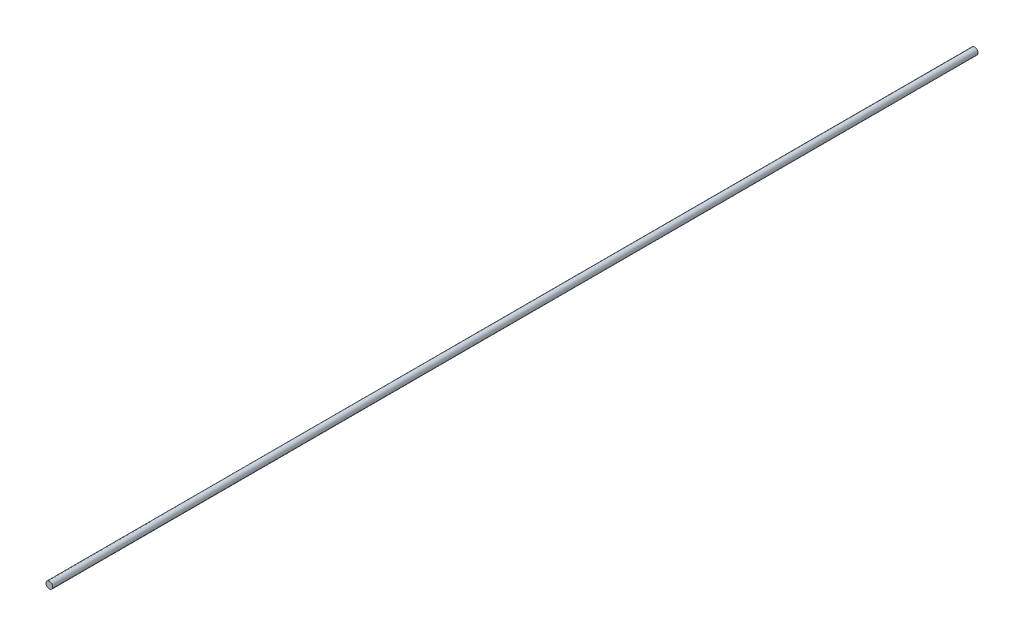
ISO-10303-21;
HEADER;
FILE_DESCRIPTION(('STEP AP214'),'2;1');
FILE_NAME('part.step','',(''),(''),'','','');
FILE_SCHEMA(('AUTOMOTIVE_DESIGN { 1 0 10303 214 1 1 1 1 }'));
ENDSEC;
DATA;
#1=APPLICATION_CONTEXT('core data for automotive mechanical design processes');
#2=APPLICATION_PROTOCOL_DEFINITION('international standard','automotive_design',2000,#1);
#3=PRODUCT_CONTEXT('',#1,'mechanical');
#4=PRODUCT('Part','Part','',(#3));
#5=PRODUCT_RELATED_PRODUCT_CATEGORY('part','',(#4));
#6=PRODUCT_DEFINITION_FORMATION('','',#4);
#7=PRODUCT_DEFINITION_CONTEXT('part definition',#1,'design');
#8=PRODUCT_DEFINITION('design','',#6,#7);
#9=PRODUCT_DEFINITION_SHAPE('','',#8);
#10=(LENGTH_UNIT() NAMED_UNIT(*) SI_UNIT(.MILLI.,.METRE.));
#11=(NAMED_UNIT(*) PLANE_ANGLE_UNIT() SI_UNIT($,.RADIAN.));
#12=(NAMED_UNIT(*) SI_UNIT($,.STERADIAN.) SOLID_ANGLE_UNIT());
#13=UNCERTAINTY_MEASURE_WITH_UNIT(LENGTH_MEASURE(1.E-05),#10,'distance_accuracy_value','');
#14=(GEOMETRIC_REPRESENTATION_CONTEXT(3) GLOBAL_UNCERTAINTY_ASSIGNED_CONTEXT((#13)) GLOBAL_UNIT_ASSIGNED_CONTEXT((#10,
#11,#12)) REPRESENTATION_CONTEXT('',''));
#15=CARTESIAN_POINT('',(0.,0.,0.));
#16=DIRECTION('',(0.,0.,1.));
#17=DIRECTION('',(1.,0.,0.));
#18=AXIS2_PLACEMENT_3D('',#15,#16,#17);
#19=CARTESIAN_POINT('',(0.,0.,660.4));
#20=DIRECTION('',(0.,0.,-1.));
#21=DIRECTION('',(-1.,0.,0.));
#22=AXIS2_PLACEMENT_3D('',#19,#20,#21);
#23=CYLINDRICAL_SURFACE('',#22,2.413);
#24=CARTESIAN_POINT('',(0.,0.,660.4));
#25=DIRECTION('',(0.,0.,1.));
#26=DIRECTION('',(1.,0.,0.));
#27=AXIS2_PLACEMENT_3D('',#24,#25,#26);
#28=CIRCLE('',#27,2.413);
#29=CARTESIAN_POINT('',(2.413,0.,660.4));
#30=VERTEX_POINT('',#29);
#31=EDGE_CURVE('E11',#30,#30,#28,.T.);
#32=ORIENTED_EDGE('',*,*,#31,.F.);
#33=EDGE_LOOP('',(#32));
#34=FACE_BOUND('',#33,.T.);
#35=CARTESIAN_POINT('',(0.,0.,0.));
#36=DIRECTION('',(0.,0.,1.));
#37=DIRECTION('',(1.,0.,0.));
#38=AXIS2_PLACEMENT_3D('',#35,#36,#37);
#39=CIRCLE('',#38,2.413);
#40=CARTESIAN_POINT('',(2.413,0.,0.));
#41=VERTEX_POINT('',#40);
#42=EDGE_CURVE('E45',#41,#41,#39,.T.);
#43=ORIENTED_EDGE('',*,*,#42,.T.);
#44=EDGE_LOOP('',(#43));
#45=FACE_BOUND('',#44,.T.);
#46=ADVANCED_FACE('F42',(#34,#45),#23,.T.);
#47=CARTESIAN_POINT('',(0.,0.,660.4));
#48=DIRECTION('',(0.,0.,1.));
#49=DIRECTION('',(1.,0.,0.));
#50=AXIS2_PLACEMENT_3D('',#47,#48,#49);
#51=PLANE('',#50);
#52=ORIENTED_EDGE('',*,*,#31,.T.);
#53=EDGE_LOOP('',(#52));
#54=FACE_BOUND('',#53,.T.);
#55=ADVANCED_FACE('F62',(#54),#51,.T.);
#56=CARTESIAN_POINT('',(0.,0.,0.));
#57=DIRECTION('',(0.,0.,1.));
#58=DIRECTION('',(1.,0.,0.));
#59=AXIS2_PLACEMENT_3D('',#56,#57,#58);
#60=PLANE('',#59);
#61=ORIENTED_EDGE('',*,*,#42,.F.);
#62=EDGE_LOOP('',(#61));
#63=FACE_BOUND('',#62,.T.);
#64=ADVANCED_FACE('F60',(#63),#60,.F.);
#65=CLOSED_SHELL('',(#46,#55,#64));
#66=MANIFOLD_SOLID_BREP('B2',#65);
#67=ADVANCED_BREP_SHAPE_REPRESENTATION('',(#18,#66),#14);
#68=SHAPE_DEFINITION_REPRESENTATION(#9,#67);
ENDSEC;
END-ISO-10303-21;
